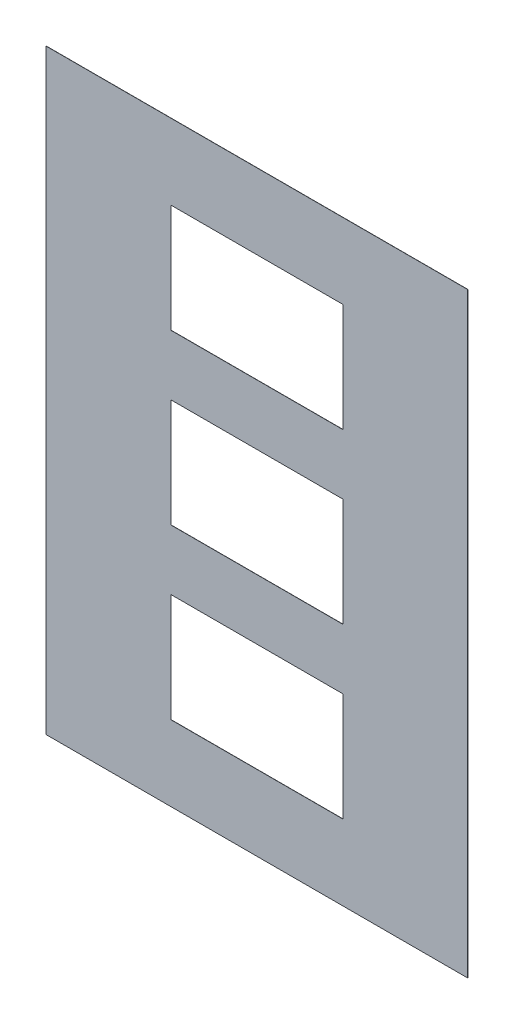
ISO-10303-21;
HEADER;
FILE_DESCRIPTION(('STEP AP214'),'2;1');
FILE_NAME('part.step','',(''),(''),'','','');
FILE_SCHEMA(('AUTOMOTIVE_DESIGN { 1 0 10303 214 1 1 1 1 }'));
ENDSEC;
DATA;
#1=APPLICATION_CONTEXT('core data for automotive mechanical design processes');
#2=APPLICATION_PROTOCOL_DEFINITION('international standard','automotive_design',2000,#1);
#3=PRODUCT_CONTEXT('',#1,'mechanical');
#4=PRODUCT('Part','Part','',(#3));
#5=PRODUCT_RELATED_PRODUCT_CATEGORY('part','',(#4));
#6=PRODUCT_DEFINITION_FORMATION('','',#4);
#7=PRODUCT_DEFINITION_CONTEXT('part definition',#1,'design');
#8=PRODUCT_DEFINITION('design','',#6,#7);
#9=PRODUCT_DEFINITION_SHAPE('','',#8);
#10=(LENGTH_UNIT() NAMED_UNIT(*) SI_UNIT(.MILLI.,.METRE.));
#11=(NAMED_UNIT(*) PLANE_ANGLE_UNIT() SI_UNIT($,.RADIAN.));
#12=(NAMED_UNIT(*) SI_UNIT($,.STERADIAN.) SOLID_ANGLE_UNIT());
#13=UNCERTAINTY_MEASURE_WITH_UNIT(LENGTH_MEASURE(1.E-05),#10,'distance_accuracy_value','');
#14=(GEOMETRIC_REPRESENTATION_CONTEXT(3) GLOBAL_UNCERTAINTY_ASSIGNED_CONTEXT((#13)) GLOBAL_UNIT_ASSIGNED_CONTEXT((#10,
#11,#12)) REPRESENTATION_CONTEXT('',''));
#15=CARTESIAN_POINT('',(0.,0.,0.));
#16=DIRECTION('',(0.,0.,1.));
#17=DIRECTION('',(1.,0.,0.));
#18=AXIS2_PLACEMENT_3D('',#15,#16,#17);
#19=CARTESIAN_POINT('',(147.8,259.5,-7.9));
#20=DIRECTION('',(0.,1.,0.));
#21=DIRECTION('',(0.,0.,1.));
#22=AXIS2_PLACEMENT_3D('',#19,#20,#21);
#23=PLANE('',#22);
#24=DIRECTION('',(1.,0.,0.));
#25=VECTOR('',#24,1.);
#26=CARTESIAN_POINT('',(0.,259.5,0.));
#27=LINE('',#26,#25);
#28=CARTESIAN_POINT('',(62.2,259.5,0.));
#29=VERTEX_POINT('',#28);
#30=CARTESIAN_POINT('',(147.8,259.5,0.));
#31=VERTEX_POINT('',#30);
#32=EDGE_CURVE('E242',#29,#31,#27,.T.);
#33=ORIENTED_EDGE('',*,*,#32,.T.);
#34=DIRECTION('',(0.,0.,1.));
#35=VECTOR('',#34,1.);
#36=CARTESIAN_POINT('',(147.8,259.5,-7.9));
#37=LINE('',#36,#35);
#38=CARTESIAN_POINT('',(147.8,259.5,0.1));
#39=VERTEX_POINT('',#38);
#40=EDGE_CURVE('E260',#31,#39,#37,.T.);
#41=ORIENTED_EDGE('',*,*,#40,.T.);
#42=DIRECTION('',(-1.,0.,0.));
#43=VECTOR('',#42,1.);
#44=CARTESIAN_POINT('',(147.8,259.5,0.1));
#45=LINE('',#44,#43);
#46=CARTESIAN_POINT('',(62.2,259.5,0.1));
#47=VERTEX_POINT('',#46);
#48=EDGE_CURVE('E256',#39,#47,#45,.T.);
#49=ORIENTED_EDGE('',*,*,#48,.T.);
#50=DIRECTION('',(0.,0.,1.));
#51=VECTOR('',#50,1.);
#52=CARTESIAN_POINT('',(62.2,259.5,-7.9));
#53=LINE('',#52,#51);
#54=EDGE_CURVE('E11',#29,#47,#53,.T.);
#55=ORIENTED_EDGE('',*,*,#54,.F.);
#56=EDGE_LOOP('',(#33,#41,#49,#55));
#57=FACE_BOUND('',#56,.T.);
#58=ADVANCED_FACE('F35',(#57),#23,.F.);
#59=CARTESIAN_POINT('',(62.2,259.5,-7.9));
#60=DIRECTION('',(-1.,0.,0.));
#61=DIRECTION('',(0.,-1.,0.));
#62=AXIS2_PLACEMENT_3D('',#59,#60,#61);
#63=PLANE('',#62);
#64=DIRECTION('',(0.,1.,0.));
#65=VECTOR('',#64,1.);
#66=CARTESIAN_POINT('',(62.1999999999999,168.,0.));
#67=LINE('',#66,#65);
#68=CARTESIAN_POINT('',(62.2,205.5,0.));
#69=VERTEX_POINT('',#68);
#70=EDGE_CURVE('E245',#69,#29,#67,.T.);
#71=ORIENTED_EDGE('',*,*,#70,.T.);
#72=ORIENTED_EDGE('',*,*,#54,.T.);
#73=DIRECTION('',(0.,-1.,0.));
#74=VECTOR('',#73,1.);
#75=CARTESIAN_POINT('',(62.2,259.5,0.1));
#76=LINE('',#75,#74);
#77=CARTESIAN_POINT('',(62.2,205.5,0.1));
#78=VERTEX_POINT('',#77);
#79=EDGE_CURVE('E56',#47,#78,#76,.T.);
#80=ORIENTED_EDGE('',*,*,#79,.T.);
#81=DIRECTION('',(0.,0.,1.));
#82=VECTOR('',#81,1.);
#83=CARTESIAN_POINT('',(62.2,205.5,-7.9));
#84=LINE('',#83,#82);
#85=EDGE_CURVE('E42',#69,#78,#84,.T.);
#86=ORIENTED_EDGE('',*,*,#85,.F.);
#87=EDGE_LOOP('',(#71,#72,#80,#86));
#88=FACE_BOUND('',#87,.T.);
#89=ADVANCED_FACE('F269',(#88),#63,.F.);
#90=CARTESIAN_POINT('',(147.8,205.5,-7.9));
#91=DIRECTION('',(0.,-1.,0.));
#92=DIRECTION('',(0.,0.,-1.));
#93=AXIS2_PLACEMENT_3D('',#90,#91,#92);
#94=PLANE('',#93);
#95=DIRECTION('',(-1.,0.,0.));
#96=VECTOR('',#95,1.);
#97=CARTESIAN_POINT('',(0.,205.5,0.));
#98=LINE('',#97,#96);
#99=CARTESIAN_POINT('',(147.8,205.5,0.));
#100=VERTEX_POINT('',#99);
#101=EDGE_CURVE('E248',#100,#69,#98,.T.);
#102=ORIENTED_EDGE('',*,*,#101,.T.);
#103=ORIENTED_EDGE('',*,*,#85,.T.);
#104=DIRECTION('',(1.,0.,0.));
#105=VECTOR('',#104,1.);
#106=CARTESIAN_POINT('',(147.8,205.5,0.1));
#107=LINE('',#106,#105);
#108=CARTESIAN_POINT('',(147.8,205.5,0.1));
#109=VERTEX_POINT('',#108);
#110=EDGE_CURVE('E252',#78,#109,#107,.T.);
#111=ORIENTED_EDGE('',*,*,#110,.T.);
#112=DIRECTION('',(0.,0.,1.));
#113=VECTOR('',#112,1.);
#114=CARTESIAN_POINT('',(147.8,205.5,-7.9));
#115=LINE('',#114,#113);
#116=EDGE_CURVE('E258',#100,#109,#115,.T.);
#117=ORIENTED_EDGE('',*,*,#116,.F.);
#118=EDGE_LOOP('',(#102,#103,#111,#117));
#119=FACE_BOUND('',#118,.T.);
#120=ADVANCED_FACE('F265',(#119),#94,.F.);
#121=CARTESIAN_POINT('',(147.8,259.5,-7.9));
#122=DIRECTION('',(1.,0.,0.));
#123=DIRECTION('',(0.,0.,-1.));
#124=AXIS2_PLACEMENT_3D('',#121,#122,#123);
#125=PLANE('',#124);
#126=DIRECTION('',(0.,-1.,0.));
#127=VECTOR('',#126,1.);
#128=CARTESIAN_POINT('',(147.8,168.,0.));
#129=LINE('',#128,#127);
#130=EDGE_CURVE('E240',#31,#100,#129,.T.);
#131=ORIENTED_EDGE('',*,*,#130,.T.);
#132=ORIENTED_EDGE('',*,*,#116,.T.);
#133=DIRECTION('',(0.,1.,0.));
#134=VECTOR('',#133,1.);
#135=CARTESIAN_POINT('',(147.8,259.5,0.1));
#136=LINE('',#135,#134);
#137=EDGE_CURVE('E49',#109,#39,#136,.T.);
#138=ORIENTED_EDGE('',*,*,#137,.T.);
#139=ORIENTED_EDGE('',*,*,#40,.F.);
#140=EDGE_LOOP('',(#131,#132,#138,#139));
#141=FACE_BOUND('',#140,.T.);
#142=ADVANCED_FACE('F297',(#141),#125,.F.);
#143=CARTESIAN_POINT('',(0.,0.,0.1));
#144=DIRECTION('',(1.,0.,0.));
#145=DIRECTION('',(0.,0.,-1.));
#146=AXIS2_PLACEMENT_3D('',#143,#144,#145);
#147=PLANE('',#146);
#148=DIRECTION('',(0.,-1.,0.));
#149=VECTOR('',#148,1.);
#150=CARTESIAN_POINT('',(0.,0.,0.));
#151=LINE('',#150,#149);
#152=CARTESIAN_POINT('',(0.,297.,0.));
#153=VERTEX_POINT('',#152);
#154=CARTESIAN_POINT('',(0.,0.,0.));
#155=VERTEX_POINT('',#154);
#156=EDGE_CURVE('E195',#153,#155,#151,.T.);
#157=ORIENTED_EDGE('',*,*,#156,.T.);
#158=DIRECTION('',(0.,0.,-1.));
#159=VECTOR('',#158,1.);
#160=CARTESIAN_POINT('',(0.,0.,0.1));
#161=LINE('',#160,#159);
#162=CARTESIAN_POINT('',(0.,0.,0.1));
#163=VERTEX_POINT('',#162);
#164=EDGE_CURVE('E228',#163,#155,#161,.T.);
#165=ORIENTED_EDGE('',*,*,#164,.F.);
#166=DIRECTION('',(0.,-1.,0.));
#167=VECTOR('',#166,1.);
#168=CARTESIAN_POINT('',(0.,0.,0.1));
#169=LINE('',#168,#167);
#170=CARTESIAN_POINT('',(0.,297.,0.1));
#171=VERTEX_POINT('',#170);
#172=EDGE_CURVE('E202',#171,#163,#169,.T.);
#173=ORIENTED_EDGE('',*,*,#172,.F.);
#174=DIRECTION('',(0.,0.,-1.));
#175=VECTOR('',#174,1.);
#176=CARTESIAN_POINT('',(0.,297.,0.1));
#177=LINE('',#176,#175);
#178=EDGE_CURVE('E212',#171,#153,#177,.T.);
#179=ORIENTED_EDGE('',*,*,#178,.T.);
#180=EDGE_LOOP('',(#157,#165,#173,#179));
#181=FACE_BOUND('',#180,.T.);
#182=ADVANCED_FACE('F302',(#181),#147,.F.);
#183=CARTESIAN_POINT('',(0.,0.,0.1));
#184=DIRECTION('',(0.,1.,0.));
#185=DIRECTION('',(0.,0.,1.));
#186=AXIS2_PLACEMENT_3D('',#183,#184,#185);
#187=PLANE('',#186);
#188=DIRECTION('',(1.,0.,0.));
#189=VECTOR('',#188,1.);
#190=CARTESIAN_POINT('',(0.,0.,0.));
#191=LINE('',#190,#189);
#192=CARTESIAN_POINT('',(210.,0.,0.));
#193=VERTEX_POINT('',#192);
#194=EDGE_CURVE('E215',#155,#193,#191,.T.);
#195=ORIENTED_EDGE('',*,*,#194,.T.);
#196=DIRECTION('',(0.,0.,-1.));
#197=VECTOR('',#196,1.);
#198=CARTESIAN_POINT('',(210.,0.,0.1));
#199=LINE('',#198,#197);
#200=CARTESIAN_POINT('',(210.,0.,0.1));
#201=VERTEX_POINT('',#200);
#202=EDGE_CURVE('E225',#201,#193,#199,.T.);
#203=ORIENTED_EDGE('',*,*,#202,.F.);
#204=DIRECTION('',(1.,0.,0.));
#205=VECTOR('',#204,1.);
#206=CARTESIAN_POINT('',(0.,0.,0.1));
#207=LINE('',#206,#205);
#208=EDGE_CURVE('E205',#163,#201,#207,.T.);
#209=ORIENTED_EDGE('',*,*,#208,.F.);
#210=ORIENTED_EDGE('',*,*,#164,.T.);
#211=EDGE_LOOP('',(#195,#203,#209,#210));
#212=FACE_BOUND('',#211,.T.);
#213=ADVANCED_FACE('F305',(#212),#187,.F.);
#214=CARTESIAN_POINT('',(210.,0.,0.1));
#215=DIRECTION('',(-1.,0.,0.));
#216=DIRECTION('',(0.,0.,1.));
#217=AXIS2_PLACEMENT_3D('',#214,#215,#216);
#218=PLANE('',#217);
#219=DIRECTION('',(0.,1.,0.));
#220=VECTOR('',#219,1.);
#221=CARTESIAN_POINT('',(210.,0.,0.));
#222=LINE('',#221,#220);
#223=CARTESIAN_POINT('',(210.,297.,0.));
#224=VERTEX_POINT('',#223);
#225=EDGE_CURVE('E217',#193,#224,#222,.T.);
#226=ORIENTED_EDGE('',*,*,#225,.T.);
#227=DIRECTION('',(0.,0.,-1.));
#228=VECTOR('',#227,1.);
#229=CARTESIAN_POINT('',(210.,297.,0.1));
#230=LINE('',#229,#228);
#231=CARTESIAN_POINT('',(210.,297.,0.1));
#232=VERTEX_POINT('',#231);
#233=EDGE_CURVE('E222',#232,#224,#230,.T.);
#234=ORIENTED_EDGE('',*,*,#233,.F.);
#235=DIRECTION('',(0.,1.,0.));
#236=VECTOR('',#235,1.);
#237=CARTESIAN_POINT('',(210.,0.,0.1));
#238=LINE('',#237,#236);
#239=EDGE_CURVE('E208',#201,#232,#238,.T.);
#240=ORIENTED_EDGE('',*,*,#239,.F.);
#241=ORIENTED_EDGE('',*,*,#202,.T.);
#242=EDGE_LOOP('',(#226,#234,#240,#241));
#243=FACE_BOUND('',#242,.T.);
#244=ADVANCED_FACE('F284',(#243),#218,.F.);
#245=CARTESIAN_POINT('',(0.,297.,0.1));
#246=DIRECTION('',(0.,-1.,0.));
#247=DIRECTION('',(0.,0.,-1.));
#248=AXIS2_PLACEMENT_3D('',#245,#246,#247);
#249=PLANE('',#248);
#250=DIRECTION('',(-1.,0.,0.));
#251=VECTOR('',#250,1.);
#252=CARTESIAN_POINT('',(0.,297.,0.));
#253=LINE('',#252,#251);
#254=EDGE_CURVE('E206',#224,#153,#253,.T.);
#255=ORIENTED_EDGE('',*,*,#254,.T.);
#256=ORIENTED_EDGE('',*,*,#178,.F.);
#257=DIRECTION('',(-1.,0.,0.));
#258=VECTOR('',#257,1.);
#259=CARTESIAN_POINT('',(0.,297.,0.1));
#260=LINE('',#259,#258);
#261=EDGE_CURVE('E210',#232,#171,#260,.T.);
#262=ORIENTED_EDGE('',*,*,#261,.F.);
#263=ORIENTED_EDGE('',*,*,#233,.T.);
#264=EDGE_LOOP('',(#255,#256,#262,#263));
#265=FACE_BOUND('',#264,.T.);
#266=ADVANCED_FACE('F274',(#265),#249,.F.);
#267=CARTESIAN_POINT('',(0.,0.,0.1));
#268=DIRECTION('',(0.,0.,-1.));
#269=DIRECTION('',(-1.,0.,0.));
#270=AXIS2_PLACEMENT_3D('',#267,#268,#269);
#271=PLANE('',#270);
#272=DIRECTION('',(-1.,0.,0.));
#273=VECTOR('',#272,1.);
#274=CARTESIAN_POINT('',(147.8,175.5,0.1));
#275=LINE('',#274,#273);
#276=CARTESIAN_POINT('',(147.8,175.5,0.1));
#277=VERTEX_POINT('',#276);
#278=CARTESIAN_POINT('',(62.2,175.5,0.1));
#279=VERTEX_POINT('',#278);
#280=EDGE_CURVE('E159',#277,#279,#275,.T.);
#281=ORIENTED_EDGE('',*,*,#280,.F.);
#282=DIRECTION('',(0.,1.,0.));
#283=VECTOR('',#282,1.);
#284=CARTESIAN_POINT('',(147.8,175.5,0.1));
#285=LINE('',#284,#283);
#286=CARTESIAN_POINT('',(147.8,121.5,0.1));
#287=VERTEX_POINT('',#286);
#288=EDGE_CURVE('E168',#287,#277,#285,.T.);
#289=ORIENTED_EDGE('',*,*,#288,.F.);
#290=DIRECTION('',(1.,0.,0.));
#291=VECTOR('',#290,1.);
#292=CARTESIAN_POINT('',(147.8,121.5,0.1));
#293=LINE('',#292,#291);
#294=CARTESIAN_POINT('',(62.2,121.5,0.1));
#295=VERTEX_POINT('',#294);
#296=EDGE_CURVE('E178',#295,#287,#293,.T.);
#297=ORIENTED_EDGE('',*,*,#296,.F.);
#298=DIRECTION('',(0.,-1.,0.));
#299=VECTOR('',#298,1.);
#300=CARTESIAN_POINT('',(62.2,175.5,0.1));
#301=LINE('',#300,#299);
#302=EDGE_CURVE('E452',#279,#295,#301,.T.);
#303=ORIENTED_EDGE('',*,*,#302,.F.);
#304=EDGE_LOOP('',(#281,#289,#297,#303));
#305=FACE_BOUND('',#304,.T.);
#306=DIRECTION('',(-1.,0.,0.));
#307=VECTOR('',#306,1.);
#308=CARTESIAN_POINT('',(147.8,91.5,0.1));
#309=LINE('',#308,#307);
#310=CARTESIAN_POINT('',(147.8,91.5,0.1));
#311=VERTEX_POINT('',#310);
#312=CARTESIAN_POINT('',(62.2,91.5,0.1));
#313=VERTEX_POINT('',#312);
#314=EDGE_CURVE('E183',#311,#313,#309,.T.);
#315=ORIENTED_EDGE('',*,*,#314,.F.);
#316=DIRECTION('',(0.,1.,0.));
#317=VECTOR('',#316,1.);
#318=CARTESIAN_POINT('',(147.8,91.5,0.1));
#319=LINE('',#318,#317);
#320=CARTESIAN_POINT('',(147.8,37.5,0.1));
#321=VERTEX_POINT('',#320);
#322=EDGE_CURVE('E176',#321,#311,#319,.T.);
#323=ORIENTED_EDGE('',*,*,#322,.F.);
#324=DIRECTION('',(1.,0.,0.));
#325=VECTOR('',#324,1.);
#326=CARTESIAN_POINT('',(147.8,37.5,0.1));
#327=LINE('',#326,#325);
#328=CARTESIAN_POINT('',(62.2,37.5,0.1));
#329=VERTEX_POINT('',#328);
#330=EDGE_CURVE('E189',#329,#321,#327,.T.);
#331=ORIENTED_EDGE('',*,*,#330,.F.);
#332=DIRECTION('',(0.,-1.,0.));
#333=VECTOR('',#332,1.);
#334=CARTESIAN_POINT('',(62.2,91.5,0.1));
#335=LINE('',#334,#333);
#336=EDGE_CURVE('E186',#313,#329,#335,.T.);
#337=ORIENTED_EDGE('',*,*,#336,.F.);
#338=EDGE_LOOP('',(#315,#323,#331,#337));
#339=FACE_BOUND('',#338,.T.);
#340=ORIENTED_EDGE('',*,*,#172,.T.);
#341=ORIENTED_EDGE('',*,*,#208,.T.);
#342=ORIENTED_EDGE('',*,*,#239,.T.);
#343=ORIENTED_EDGE('',*,*,#261,.T.);
#344=EDGE_LOOP('',(#340,#341,#342,#343));
#345=FACE_BOUND('',#344,.T.);
#346=ORIENTED_EDGE('',*,*,#137,.F.);
#347=ORIENTED_EDGE('',*,*,#110,.F.);
#348=ORIENTED_EDGE('',*,*,#79,.F.);
#349=ORIENTED_EDGE('',*,*,#48,.F.);
#350=EDGE_LOOP('',(#346,#347,#348,#349));
#351=FACE_BOUND('',#350,.T.);
#352=ADVANCED_FACE('F272',(#305,#339,#345,#351),#271,.F.);
#353=CARTESIAN_POINT('',(0.,0.,0.));
#354=DIRECTION('',(0.,0.,-1.));
#355=DIRECTION('',(-1.,0.,0.));
#356=AXIS2_PLACEMENT_3D('',#353,#354,#355);
#357=PLANE('',#356);
#358=DIRECTION('',(0.,-1.,0.));
#359=VECTOR('',#358,1.);
#360=CARTESIAN_POINT('',(147.8,84.,0.));
#361=LINE('',#360,#359);
#362=CARTESIAN_POINT('',(147.8,175.5,0.));
#363=VERTEX_POINT('',#362);
#364=CARTESIAN_POINT('',(147.8,121.5,0.));
#365=VERTEX_POINT('',#364);
#366=EDGE_CURVE('E165',#363,#365,#361,.T.);
#367=ORIENTED_EDGE('',*,*,#366,.F.);
#368=DIRECTION('',(1.,0.,0.));
#369=VECTOR('',#368,1.);
#370=CARTESIAN_POINT('',(0.,175.5,0.));
#371=LINE('',#370,#369);
#372=CARTESIAN_POINT('',(62.2,175.5,0.));
#373=VERTEX_POINT('',#372);
#374=EDGE_CURVE('E149',#373,#363,#371,.T.);
#375=ORIENTED_EDGE('',*,*,#374,.F.);
#376=DIRECTION('',(0.,1.,0.));
#377=VECTOR('',#376,1.);
#378=CARTESIAN_POINT('',(62.1999999999999,83.9999999999999,0.));
#379=LINE('',#378,#377);
#380=CARTESIAN_POINT('',(62.2,121.5,0.));
#381=VERTEX_POINT('',#380);
#382=EDGE_CURVE('E448',#381,#373,#379,.T.);
#383=ORIENTED_EDGE('',*,*,#382,.F.);
#384=DIRECTION('',(-1.,0.,0.));
#385=VECTOR('',#384,1.);
#386=CARTESIAN_POINT('',(0.,121.5,0.));
#387=LINE('',#386,#385);
#388=EDGE_CURVE('E173',#365,#381,#387,.T.);
#389=ORIENTED_EDGE('',*,*,#388,.F.);
#390=EDGE_LOOP('',(#367,#375,#383,#389));
#391=FACE_BOUND('',#390,.T.);
#392=DIRECTION('',(0.,-1.,0.));
#393=VECTOR('',#392,1.);
#394=CARTESIAN_POINT('',(147.8,0.,0.));
#395=LINE('',#394,#393);
#396=CARTESIAN_POINT('',(147.8,91.5,0.));
#397=VERTEX_POINT('',#396);
#398=CARTESIAN_POINT('',(147.8,37.5,0.));
#399=VERTEX_POINT('',#398);
#400=EDGE_CURVE('E238',#397,#399,#395,.T.);
#401=ORIENTED_EDGE('',*,*,#400,.F.);
#402=DIRECTION('',(1.,0.,0.));
#403=VECTOR('',#402,1.);
#404=CARTESIAN_POINT('',(0.,91.5,0.));
#405=LINE('',#404,#403);
#406=CARTESIAN_POINT('',(62.2,91.5,0.));
#407=VERTEX_POINT('',#406);
#408=EDGE_CURVE('E231',#407,#397,#405,.T.);
#409=ORIENTED_EDGE('',*,*,#408,.F.);
#410=DIRECTION('',(0.,1.,0.));
#411=VECTOR('',#410,1.);
#412=CARTESIAN_POINT('',(62.1999999999999,0.,0.));
#413=LINE('',#412,#411);
#414=CARTESIAN_POINT('',(62.2,37.5,0.));
#415=VERTEX_POINT('',#414);
#416=EDGE_CURVE('E233',#415,#407,#413,.T.);
#417=ORIENTED_EDGE('',*,*,#416,.F.);
#418=DIRECTION('',(-1.,0.,0.));
#419=VECTOR('',#418,1.);
#420=CARTESIAN_POINT('',(0.,37.5,0.));
#421=LINE('',#420,#419);
#422=EDGE_CURVE('E236',#399,#415,#421,.T.);
#423=ORIENTED_EDGE('',*,*,#422,.F.);
#424=EDGE_LOOP('',(#401,#409,#417,#423));
#425=FACE_BOUND('',#424,.T.);
#426=ORIENTED_EDGE('',*,*,#156,.F.);
#427=ORIENTED_EDGE('',*,*,#254,.F.);
#428=ORIENTED_EDGE('',*,*,#225,.F.);
#429=ORIENTED_EDGE('',*,*,#194,.F.);
#430=EDGE_LOOP('',(#426,#427,#428,#429));
#431=FACE_BOUND('',#430,.T.);
#432=ORIENTED_EDGE('',*,*,#130,.F.);
#433=ORIENTED_EDGE('',*,*,#32,.F.);
#434=ORIENTED_EDGE('',*,*,#70,.F.);
#435=ORIENTED_EDGE('',*,*,#101,.F.);
#436=EDGE_LOOP('',(#432,#433,#434,#435));
#437=FACE_BOUND('',#436,.T.);
#438=ADVANCED_FACE('F170',(#391,#425,#431,#437),#357,.T.);
#439=CARTESIAN_POINT('',(147.8,91.5,-7.9));
#440=DIRECTION('',(1.,0.,0.));
#441=DIRECTION('',(0.,0.,-1.));
#442=AXIS2_PLACEMENT_3D('',#439,#440,#441);
#443=PLANE('',#442);
#444=ORIENTED_EDGE('',*,*,#400,.T.);
#445=DIRECTION('',(0.,0.,1.));
#446=VECTOR('',#445,1.);
#447=CARTESIAN_POINT('',(147.8,37.5,-7.9));
#448=LINE('',#447,#446);
#449=EDGE_CURVE('E193',#399,#321,#448,.T.);
#450=ORIENTED_EDGE('',*,*,#449,.T.);
#451=ORIENTED_EDGE('',*,*,#322,.T.);
#452=DIRECTION('',(0.,0.,1.));
#453=VECTOR('',#452,1.);
#454=CARTESIAN_POINT('',(147.8,91.5,-7.9));
#455=LINE('',#454,#453);
#456=EDGE_CURVE('E192',#397,#311,#455,.T.);
#457=ORIENTED_EDGE('',*,*,#456,.F.);
#458=EDGE_LOOP('',(#444,#450,#451,#457));
#459=FACE_BOUND('',#458,.T.);
#460=ADVANCED_FACE('F281',(#459),#443,.F.);
#461=CARTESIAN_POINT('',(147.8,37.5,-7.9));
#462=DIRECTION('',(0.,-1.,0.));
#463=DIRECTION('',(0.,0.,-1.));
#464=AXIS2_PLACEMENT_3D('',#461,#462,#463);
#465=PLANE('',#464);
#466=ORIENTED_EDGE('',*,*,#422,.T.);
#467=DIRECTION('',(0.,0.,1.));
#468=VECTOR('',#467,1.);
#469=CARTESIAN_POINT('',(62.2,37.5,-7.9));
#470=LINE('',#469,#468);
#471=EDGE_CURVE('E196',#415,#329,#470,.T.);
#472=ORIENTED_EDGE('',*,*,#471,.T.);
#473=ORIENTED_EDGE('',*,*,#330,.T.);
#474=ORIENTED_EDGE('',*,*,#449,.F.);
#475=EDGE_LOOP('',(#466,#472,#473,#474));
#476=FACE_BOUND('',#475,.T.);
#477=ADVANCED_FACE('F386',(#476),#465,.F.);
#478=CARTESIAN_POINT('',(62.2,91.5,-7.9));
#479=DIRECTION('',(-1.,0.,0.));
#480=DIRECTION('',(0.,-1.,0.));
#481=AXIS2_PLACEMENT_3D('',#478,#479,#480);
#482=PLANE('',#481);
#483=ORIENTED_EDGE('',*,*,#416,.T.);
#484=DIRECTION('',(0.,0.,1.));
#485=VECTOR('',#484,1.);
#486=CARTESIAN_POINT('',(62.2,91.5,-7.9));
#487=LINE('',#486,#485);
#488=EDGE_CURVE('E198',#407,#313,#487,.T.);
#489=ORIENTED_EDGE('',*,*,#488,.T.);
#490=ORIENTED_EDGE('',*,*,#336,.T.);
#491=ORIENTED_EDGE('',*,*,#471,.F.);
#492=EDGE_LOOP('',(#483,#489,#490,#491));
#493=FACE_BOUND('',#492,.T.);
#494=ADVANCED_FACE('F389',(#493),#482,.F.);
#495=CARTESIAN_POINT('',(147.8,91.5,-7.9));
#496=DIRECTION('',(0.,1.,0.));
#497=DIRECTION('',(0.,0.,1.));
#498=AXIS2_PLACEMENT_3D('',#495,#496,#497);
#499=PLANE('',#498);
#500=ORIENTED_EDGE('',*,*,#408,.T.);
#501=ORIENTED_EDGE('',*,*,#456,.T.);
#502=ORIENTED_EDGE('',*,*,#314,.T.);
#503=ORIENTED_EDGE('',*,*,#488,.F.);
#504=EDGE_LOOP('',(#500,#501,#502,#503));
#505=FACE_BOUND('',#504,.T.);
#506=ADVANCED_FACE('F352',(#505),#499,.F.);
#507=CARTESIAN_POINT('',(147.8,175.5,-7.9));
#508=DIRECTION('',(1.,0.,0.));
#509=DIRECTION('',(0.,0.,-1.));
#510=AXIS2_PLACEMENT_3D('',#507,#508,#509);
#511=PLANE('',#510);
#512=ORIENTED_EDGE('',*,*,#366,.T.);
#513=DIRECTION('',(0.,0.,1.));
#514=VECTOR('',#513,1.);
#515=CARTESIAN_POINT('',(147.8,121.5,-7.9));
#516=LINE('',#515,#514);
#517=EDGE_CURVE('E174',#365,#287,#516,.T.);
#518=ORIENTED_EDGE('',*,*,#517,.T.);
#519=ORIENTED_EDGE('',*,*,#288,.T.);
#520=DIRECTION('',(0.,0.,1.));
#521=VECTOR('',#520,1.);
#522=CARTESIAN_POINT('',(147.8,175.5,-7.9));
#523=LINE('',#522,#521);
#524=EDGE_CURVE('E152',#363,#277,#523,.T.);
#525=ORIENTED_EDGE('',*,*,#524,.F.);
#526=EDGE_LOOP('',(#512,#518,#519,#525));
#527=FACE_BOUND('',#526,.T.);
#528=ADVANCED_FACE('F163',(#527),#511,.F.);
#529=CARTESIAN_POINT('',(147.8,121.5,-7.9));
#530=DIRECTION('',(0.,-1.,0.));
#531=DIRECTION('',(0.,0.,-1.));
#532=AXIS2_PLACEMENT_3D('',#529,#530,#531);
#533=PLANE('',#532);
#534=ORIENTED_EDGE('',*,*,#388,.T.);
#535=DIRECTION('',(0.,0.,1.));
#536=VECTOR('',#535,1.);
#537=CARTESIAN_POINT('',(62.2,121.5,-7.9));
#538=LINE('',#537,#536);
#539=EDGE_CURVE('E451',#381,#295,#538,.T.);
#540=ORIENTED_EDGE('',*,*,#539,.T.);
#541=ORIENTED_EDGE('',*,*,#296,.T.);
#542=ORIENTED_EDGE('',*,*,#517,.F.);
#543=EDGE_LOOP('',(#534,#540,#541,#542));
#544=FACE_BOUND('',#543,.T.);
#545=ADVANCED_FACE('F351',(#544),#533,.F.);
#546=CARTESIAN_POINT('',(62.2,175.5,-7.9));
#547=DIRECTION('',(-1.,0.,0.));
#548=DIRECTION('',(0.,-1.,0.));
#549=AXIS2_PLACEMENT_3D('',#546,#547,#548);
#550=PLANE('',#549);
#551=ORIENTED_EDGE('',*,*,#382,.T.);
#552=DIRECTION('',(0.,0.,1.));
#553=VECTOR('',#552,1.);
#554=CARTESIAN_POINT('',(62.2,175.5,-7.9));
#555=LINE('',#554,#553);
#556=EDGE_CURVE('E155',#373,#279,#555,.T.);
#557=ORIENTED_EDGE('',*,*,#556,.T.);
#558=ORIENTED_EDGE('',*,*,#302,.T.);
#559=ORIENTED_EDGE('',*,*,#539,.F.);
#560=EDGE_LOOP('',(#551,#557,#558,#559));
#561=FACE_BOUND('',#560,.T.);
#562=ADVANCED_FACE('F363',(#561),#550,.F.);
#563=CARTESIAN_POINT('',(147.8,175.5,-7.9));
#564=DIRECTION('',(0.,1.,0.));
#565=DIRECTION('',(0.,0.,1.));
#566=AXIS2_PLACEMENT_3D('',#563,#564,#565);
#567=PLANE('',#566);
#568=ORIENTED_EDGE('',*,*,#374,.T.);
#569=ORIENTED_EDGE('',*,*,#524,.T.);
#570=ORIENTED_EDGE('',*,*,#280,.T.);
#571=ORIENTED_EDGE('',*,*,#556,.F.);
#572=EDGE_LOOP('',(#568,#569,#570,#571));
#573=FACE_BOUND('',#572,.T.);
#574=ADVANCED_FACE('F151',(#573),#567,.F.);
#575=CLOSED_SHELL('',(#58,#89,#120,#142,#182,#213,#244,#266,#352,#438,#460,#477,#494,#506,#528,
#545,#562,#574));
#576=MANIFOLD_SOLID_BREP('B2',#575);
#577=ADVANCED_BREP_SHAPE_REPRESENTATION('',(#18,#576),#14);
#578=SHAPE_DEFINITION_REPRESENTATION(#9,#577);
ENDSEC;
END-ISO-10303-21;
